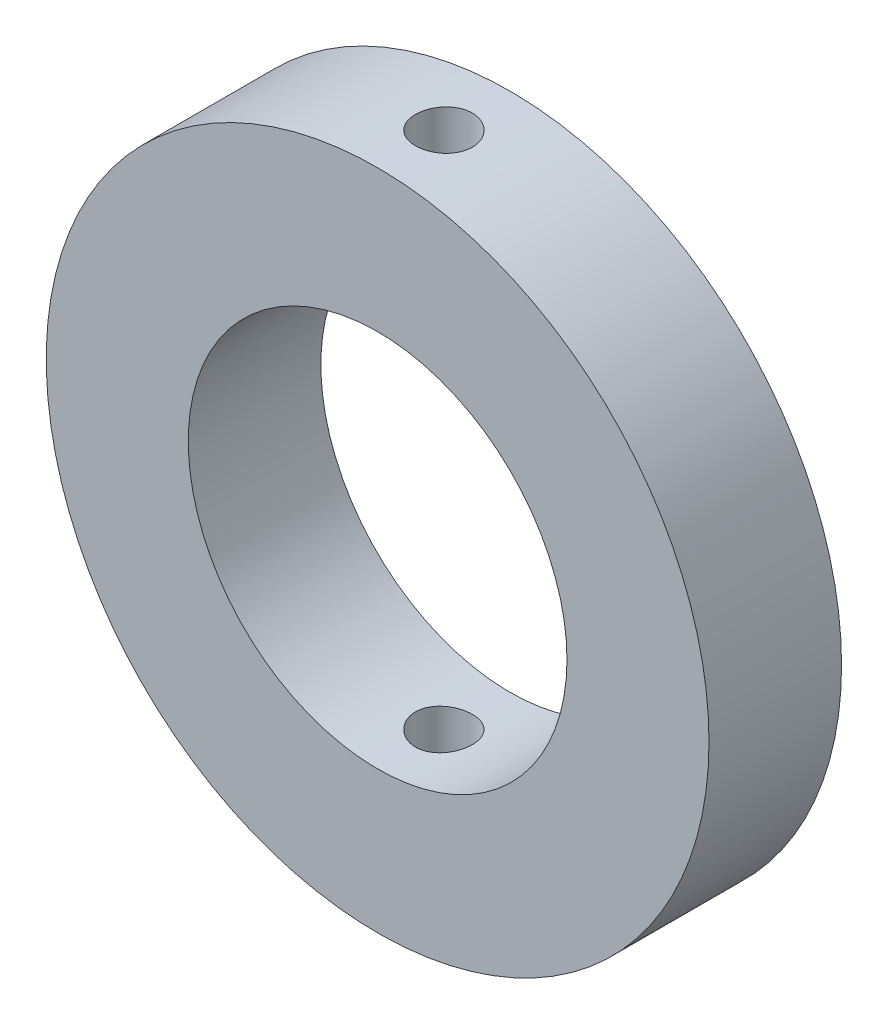
ISO-10303-21;
HEADER;
FILE_DESCRIPTION(('STEP AP214'),'2;1');
FILE_NAME('part.step','',(''),(''),'','','');
FILE_SCHEMA(('AUTOMOTIVE_DESIGN { 1 0 10303 214 1 1 1 1 }'));
ENDSEC;
DATA;
#1=APPLICATION_CONTEXT('core data for automotive mechanical design processes');
#2=APPLICATION_PROTOCOL_DEFINITION('international standard','automotive_design',2000,#1);
#3=PRODUCT_CONTEXT('',#1,'mechanical');
#4=PRODUCT('Part','Part','',(#3));
#5=PRODUCT_RELATED_PRODUCT_CATEGORY('part','',(#4));
#6=PRODUCT_DEFINITION_FORMATION('','',#4);
#7=PRODUCT_DEFINITION_CONTEXT('part definition',#1,'design');
#8=PRODUCT_DEFINITION('design','',#6,#7);
#9=PRODUCT_DEFINITION_SHAPE('','',#8);
#10=(LENGTH_UNIT() NAMED_UNIT(*) SI_UNIT(.MILLI.,.METRE.));
#11=(NAMED_UNIT(*) PLANE_ANGLE_UNIT() SI_UNIT($,.RADIAN.));
#12=(NAMED_UNIT(*) SI_UNIT($,.STERADIAN.) SOLID_ANGLE_UNIT());
#13=UNCERTAINTY_MEASURE_WITH_UNIT(LENGTH_MEASURE(1.E-05),#10,'distance_accuracy_value','');
#14=(GEOMETRIC_REPRESENTATION_CONTEXT(3) GLOBAL_UNCERTAINTY_ASSIGNED_CONTEXT((#13)) GLOBAL_UNIT_ASSIGNED_CONTEXT((#10,
#11,#12)) REPRESENTATION_CONTEXT('',''));
#15=CARTESIAN_POINT('',(0.,0.,0.));
#16=DIRECTION('',(0.,0.,1.));
#17=DIRECTION('',(1.,0.,0.));
#18=AXIS2_PLACEMENT_3D('',#15,#16,#17);
#19=CARTESIAN_POINT('',(0.,0.,7.));
#20=DIRECTION('',(0.,0.,1.));
#21=DIRECTION('',(1.,0.,0.));
#22=AXIS2_PLACEMENT_3D('',#19,#20,#21);
#23=PLANE('',#22);
#24=CARTESIAN_POINT('',(0.,0.,7.));
#25=DIRECTION('',(0.,0.,1.));
#26=DIRECTION('',(1.,0.,0.));
#27=AXIS2_PLACEMENT_3D('',#24,#25,#26);
#28=CIRCLE('',#27,17.5);
#29=CARTESIAN_POINT('',(17.5,0.,7.));
#30=VERTEX_POINT('',#29);
#31=EDGE_CURVE('E10',#30,#30,#28,.T.);
#32=ORIENTED_EDGE('',*,*,#31,.T.);
#33=EDGE_LOOP('',(#32));
#34=FACE_BOUND('',#33,.T.);
#35=CARTESIAN_POINT('',(0.,0.,7.));
#36=DIRECTION('',(0.,0.,1.));
#37=DIRECTION('',(1.,0.,0.));
#38=AXIS2_PLACEMENT_3D('',#35,#36,#37);
#39=CIRCLE('',#38,10.);
#40=CARTESIAN_POINT('',(10.,0.,7.));
#41=VERTEX_POINT('',#40);
#42=EDGE_CURVE('E55',#41,#41,#39,.T.);
#43=ORIENTED_EDGE('',*,*,#42,.F.);
#44=EDGE_LOOP('',(#43));
#45=FACE_BOUND('',#44,.T.);
#46=ADVANCED_FACE('F36',(#34,#45),#23,.T.);
#47=CARTESIAN_POINT('',(0.,0.,0.));
#48=DIRECTION('',(0.,0.,1.));
#49=DIRECTION('',(1.,0.,0.));
#50=AXIS2_PLACEMENT_3D('',#47,#48,#49);
#51=PLANE('',#50);
#52=CARTESIAN_POINT('',(0.,0.,0.));
#53=DIRECTION('',(0.,0.,1.));
#54=DIRECTION('',(1.,0.,0.));
#55=AXIS2_PLACEMENT_3D('',#52,#53,#54);
#56=CIRCLE('',#55,17.5);
#57=CARTESIAN_POINT('',(17.5,0.,0.));
#58=VERTEX_POINT('',#57);
#59=EDGE_CURVE('E50',#58,#58,#56,.T.);
#60=ORIENTED_EDGE('',*,*,#59,.F.);
#61=EDGE_LOOP('',(#60));
#62=FACE_BOUND('',#61,.T.);
#63=CARTESIAN_POINT('',(0.,0.,0.));
#64=DIRECTION('',(0.,0.,1.));
#65=DIRECTION('',(1.,0.,0.));
#66=AXIS2_PLACEMENT_3D('',#63,#64,#65);
#67=CIRCLE('',#66,10.);
#68=CARTESIAN_POINT('',(10.,0.,0.));
#69=VERTEX_POINT('',#68);
#70=EDGE_CURVE('E58',#69,#69,#67,.T.);
#71=ORIENTED_EDGE('',*,*,#70,.T.);
#72=EDGE_LOOP('',(#71));
#73=FACE_BOUND('',#72,.T.);
#74=ADVANCED_FACE('F94',(#62,#73),#51,.F.);
#75=CARTESIAN_POINT('',(0.,0.,7.));
#76=DIRECTION('',(0.,0.,-1.));
#77=DIRECTION('',(-1.,0.,0.));
#78=AXIS2_PLACEMENT_3D('',#75,#76,#77);
#79=CYLINDRICAL_SURFACE('',#78,17.5);
#80=CARTESIAN_POINT('',(0.,-17.5,5.));
#81=CARTESIAN_POINT('',(0.0840900887107123,-17.4999991594733,4.99999633105431));
#82=CARTESIAN_POINT('',(0.168237205347033,-17.4993874435045,4.9929050688566));
#83=CARTESIAN_POINT('',(0.334202638193609,-17.4970060027991,4.96472138311456));
#84=CARTESIAN_POINT('',(0.416018216761205,-17.4952349709134,4.94361315480395));
#85=CARTESIAN_POINT('',(0.574892903023323,-17.4907350049708,4.88801096542443));
#86=CARTESIAN_POINT('',(0.65195469695322,-17.4880066178289,4.85352464576534));
#87=CARTESIAN_POINT('',(0.799177678621249,-17.4818977976165,4.77215904202089));
#88=CARTESIAN_POINT('',(0.869340324379601,-17.478517502765,4.72528238418373));
#89=CARTESIAN_POINT('',(1.00098012086048,-17.4714739349038,4.62033085552535));
#90=CARTESIAN_POINT('',(1.0624361682522,-17.4678100065351,4.56222955660025));
#91=CARTESIAN_POINT('',(1.17473714274468,-17.4606176074471,4.43653395532203));
#92=CARTESIAN_POINT('',(1.22558160053927,-17.4570891427244,4.36893923333563));
#93=CARTESIAN_POINT('',(1.31528804394571,-17.4505601834405,4.22604711952868));
#94=CARTESIAN_POINT('',(1.3541313994292,-17.447560512831,4.15073799100038));
#95=CARTESIAN_POINT('',(1.41861401911449,-17.4424363752803,3.99463655208879));
#96=CARTESIAN_POINT('',(1.44425352872523,-17.4403118920728,3.91384434364657));
#97=CARTESIAN_POINT('',(1.48153922884676,-17.4371842440243,3.74928217785536));
#98=CARTESIAN_POINT('',(1.49321989768765,-17.4361783167802,3.66552008580619));
#99=CARTESIAN_POINT('',(1.50236286720603,-17.4353929686056,3.49721865783491));
#100=CARTESIAN_POINT('',(1.49982544877632,-17.4356135234447,3.41267933730069));
#101=CARTESIAN_POINT('',(1.48063275656642,-17.4372537073855,3.24545967504623));
#102=CARTESIAN_POINT('',(1.4640149768294,-17.4386701519636,3.1627749943305));
#103=CARTESIAN_POINT('',(1.41719154226227,-17.4425375250174,3.00137274937773));
#104=CARTESIAN_POINT('',(1.38698574798361,-17.4449884641096,2.92265522586332));
#105=CARTESIAN_POINT('',(1.31380181438494,-17.4506523313746,2.77130244880465));
#106=CARTESIAN_POINT('',(1.27080687785468,-17.4538662605277,2.69867535622966));
#107=CARTESIAN_POINT('',(1.17327723208652,-17.4606930646245,2.56165431191238));
#108=CARTESIAN_POINT('',(1.11874227540577,-17.4643059481219,2.49726053675762));
#109=CARTESIAN_POINT('',(0.99947045887247,-17.4715377484946,2.37831603911806));
#110=CARTESIAN_POINT('',(0.934701189276639,-17.4751566471183,2.32379780916566));
#111=CARTESIAN_POINT('',(0.79691230790879,-17.4819816038833,2.22640328146127));
#112=CARTESIAN_POINT('',(0.723892690194866,-17.4851876617273,2.18352699209389));
#113=CARTESIAN_POINT('',(0.571654568400853,-17.4908263664502,2.11063537405045));
#114=CARTESIAN_POINT('',(0.492435358600528,-17.4932589251192,2.08062151207312));
#115=CARTESIAN_POINT('',(0.330056610564175,-17.497075554016,2.03432962167256));
#116=CARTESIAN_POINT('',(0.246897158890748,-17.4984596472661,2.01805129164306));
#117=CARTESIAN_POINT('',(0.0792801254169853,-17.5000204405764,1.99973334895508));
#118=CARTESIAN_POINT('',(-0.00517251833806496,-17.50020094583,1.99764886143084));
#119=CARTESIAN_POINT('',(-0.173226052241329,-17.4993443933604,2.00766017788266));
#120=CARTESIAN_POINT('',(-0.256826950793808,-17.4983073476627,2.01975584180464));
#121=CARTESIAN_POINT('',(-0.420675710779483,-17.4951347543422,2.05774691116821));
#122=CARTESIAN_POINT('',(-0.500928436352369,-17.4930008648631,2.08362148858151));
#123=CARTESIAN_POINT('',(-0.655953511227377,-17.4878742551377,2.14841461003281));
#124=CARTESIAN_POINT('',(-0.730725769009281,-17.4848815205533,2.18733337183968));
#125=CARTESIAN_POINT('',(-0.872871440837197,-17.4783631237428,2.27722267647234));
#126=CARTESIAN_POINT('',(-0.940226014804557,-17.4748361561913,2.32822291576338));
#127=CARTESIAN_POINT('',(-1.06543412084655,-17.467649837578,2.44078460996224));
#128=CARTESIAN_POINT('',(-1.1232874782242,-17.4639904840836,2.50234625901808));
#129=CARTESIAN_POINT('',(-1.22800508301078,-17.4569405366366,2.63447813486955));
#130=CARTESIAN_POINT('',(-1.27484002450932,-17.4535506749448,2.70507163178117));
#131=CARTESIAN_POINT('',(-1.35599031614564,-17.4474340063892,2.85314762251097));
#132=CARTESIAN_POINT('',(-1.39030579747788,-17.4447071925772,2.93063004412785));
#133=CARTESIAN_POINT('',(-1.4453932712282,-17.4402295391797,3.090181105562));
#134=CARTESIAN_POINT('',(-1.46618313697926,-17.4384774120469,3.17224353672203));
#135=CARTESIAN_POINT('',(-1.49368739816738,-17.4361432515205,3.33871002868893));
#136=CARTESIAN_POINT('',(-1.5004020813581,-17.435561194206,3.42311404158866));
#137=CARTESIAN_POINT('',(-1.49956196176542,-17.4356334475388,3.59157653239517));
#138=CARTESIAN_POINT('',(-1.49205320334771,-17.4362837687124,3.67563524546447));
#139=CARTESIAN_POINT('',(-1.46307542778588,-17.4387390238802,3.84129296372411));
#140=CARTESIAN_POINT('',(-1.44160638999741,-17.4405439595818,3.92289196527686));
#141=CARTESIAN_POINT('',(-1.3853292896036,-17.4451040158272,4.08131651078694));
#142=CARTESIAN_POINT('',(-1.35052212863537,-17.447859072143,4.1581423769932));
#143=CARTESIAN_POINT('',(-1.26856192068809,-17.4540090548504,4.30486778789871));
#144=CARTESIAN_POINT('',(-1.2214090509481,-17.4574039720557,4.37476743201323));
#145=CARTESIAN_POINT('',(-1.11592285951566,-17.4644642414072,4.50589192296983));
#146=CARTESIAN_POINT('',(-1.05755540365527,-17.4681303976252,4.56708926650846));
#147=CARTESIAN_POINT('',(-0.931359803734685,-17.4753127111157,4.6788440133835));
#148=CARTESIAN_POINT('',(-0.863529377072589,-17.4788288319294,4.72939884219145));
#149=CARTESIAN_POINT('',(-0.720195326926258,-17.4853216091624,4.81850541422066));
#150=CARTESIAN_POINT('',(-0.644677026557885,-17.4882972023409,4.85703360517277));
#151=CARTESIAN_POINT('',(-0.488268737743217,-17.4933613340228,4.92081338883362));
#152=CARTESIAN_POINT('',(-0.407385029028375,-17.4954508890876,4.94608020442536));
#153=CARTESIAN_POINT('',(-0.271688875746323,-17.4979725842776,4.97620274715356));
#154=CARTESIAN_POINT('',(-0.21774845549635,-17.4987293930011,4.98511481222658));
#155=CARTESIAN_POINT('',(-0.109213375322046,-17.4997433731255,4.9970146217833));
#156=CARTESIAN_POINT('',(-0.0546187172544691,-17.5000005459441,5.00000238307641));
#157=CARTESIAN_POINT('',(0.,-17.5,5.));
#158=B_SPLINE_CURVE_WITH_KNOTS('',3,(#80,#81,#82,#83,#84,#85,#86,#87,#88,#89,#90,#91,#92,#93,
#94,#95,#96,#97,#98,#99,#100,#101,#102,#103,#104,#105,#106,#107,#108,#109,#110,#111,#112,#113,
#114,#115,#116,#117,#118,#119,#120,#121,#122,#123,#124,#125,#126,#127,#128,#129,#130,#131,#132,
#133,#134,#135,#136,#137,#138,#139,#140,#141,#142,#143,#144,#145,#146,#147,#148,#149,#150,#151,
#152,#153,#154,#155,#156,#157),.UNSPECIFIED.,.T.,.F.,(4,2,2,2,2,2,2,2,2,2,2,2,2,2,2,2,2,2,2,2,2,
2,2,2,2,2,2,2,2,2,2,2,2,2,2,2,2,2,4),(0.,0.252070844310374,0.504426393652047,0.756638012182109,
1.0087962149074,1.26155551650305,1.51432599421665,1.76748691573707,2.02064313179526,
2.27317275110476,2.525697381452,2.77755167951108,3.02940856231232,3.28159770462397,
3.53379225496101,3.78680207360298,4.03981207446395,4.29285091830753,4.54588420575254,
4.79811713708821,5.0503475771986,5.30219782677344,5.55405228112454,5.80653234151375,
6.05901704368432,6.31216587866226,6.5653120607557,6.81812304140249,7.07092885351994,
7.32291767673277,7.57490687258537,7.82687903735056,8.07884758491874,8.33159556665816,
8.58440462052468,8.83770569919965,9.09071537122188,9.25444245783791,9.41816907989973),.UNSPECIFIED.);
#159=CARTESIAN_POINT('',(0.,-17.5,5.));
#160=VERTEX_POINT('',#159);
#161=EDGE_CURVE('E83',#160,#160,#158,.T.);
#162=ORIENTED_EDGE('',*,*,#161,.T.);
#163=EDGE_LOOP('',(#162));
#164=FACE_BOUND('',#163,.T.);
#165=CARTESIAN_POINT('',(0.,17.5,5.));
#166=CARTESIAN_POINT('',(-0.0840900887107123,17.4999991594733,4.99999633105431));
#167=CARTESIAN_POINT('',(-0.168237205347033,17.4993874435045,4.9929050688566));
#168=CARTESIAN_POINT('',(-0.334202638193609,17.4970060027991,4.96472138311456));
#169=CARTESIAN_POINT('',(-0.416018216761205,17.4952349709134,4.94361315480395));
#170=CARTESIAN_POINT('',(-0.574892903023323,17.4907350049708,4.88801096542443));
#171=CARTESIAN_POINT('',(-0.65195469695322,17.4880066178289,4.85352464576534));
#172=CARTESIAN_POINT('',(-0.799177678621249,17.4818977976165,4.77215904202089));
#173=CARTESIAN_POINT('',(-0.869340324379601,17.478517502765,4.72528238418373));
#174=CARTESIAN_POINT('',(-1.00098012086048,17.4714739349038,4.62033085552535));
#175=CARTESIAN_POINT('',(-1.0624361682522,17.4678100065351,4.56222955660025));
#176=CARTESIAN_POINT('',(-1.17473714274468,17.4606176074471,4.43653395532203));
#177=CARTESIAN_POINT('',(-1.22558160053927,17.4570891427244,4.36893923333563));
#178=CARTESIAN_POINT('',(-1.31528804394571,17.4505601834405,4.22604711952868));
#179=CARTESIAN_POINT('',(-1.3541313994292,17.447560512831,4.15073799100038));
#180=CARTESIAN_POINT('',(-1.41861401911449,17.4424363752803,3.99463655208879));
#181=CARTESIAN_POINT('',(-1.44425352872523,17.4403118920728,3.91384434364657));
#182=CARTESIAN_POINT('',(-1.48153922884676,17.4371842440243,3.74928217785536));
#183=CARTESIAN_POINT('',(-1.49321989768765,17.4361783167802,3.66552008580619));
#184=CARTESIAN_POINT('',(-1.50236286720603,17.4353929686056,3.49721865783491));
#185=CARTESIAN_POINT('',(-1.49982544877632,17.4356135234447,3.41267933730069));
#186=CARTESIAN_POINT('',(-1.48063275656642,17.4372537073855,3.24545967504623));
#187=CARTESIAN_POINT('',(-1.4640149768294,17.4386701519636,3.1627749943305));
#188=CARTESIAN_POINT('',(-1.41719154226227,17.4425375250174,3.00137274937773));
#189=CARTESIAN_POINT('',(-1.38698574798361,17.4449884641096,2.92265522586332));
#190=CARTESIAN_POINT('',(-1.31380181438494,17.4506523313746,2.77130244880465));
#191=CARTESIAN_POINT('',(-1.27080687785468,17.4538662605277,2.69867535622966));
#192=CARTESIAN_POINT('',(-1.17327723208652,17.4606930646245,2.56165431191238));
#193=CARTESIAN_POINT('',(-1.11874227540577,17.4643059481219,2.49726053675762));
#194=CARTESIAN_POINT('',(-0.99947045887247,17.4715377484946,2.37831603911806));
#195=CARTESIAN_POINT('',(-0.934701189276639,17.4751566471183,2.32379780916566));
#196=CARTESIAN_POINT('',(-0.79691230790879,17.4819816038833,2.22640328146127));
#197=CARTESIAN_POINT('',(-0.723892690194866,17.4851876617273,2.18352699209389));
#198=CARTESIAN_POINT('',(-0.571654568400853,17.4908263664502,2.11063537405045));
#199=CARTESIAN_POINT('',(-0.492435358600528,17.4932589251192,2.08062151207312));
#200=CARTESIAN_POINT('',(-0.330056610564175,17.497075554016,2.03432962167256));
#201=CARTESIAN_POINT('',(-0.246897158890748,17.4984596472661,2.01805129164306));
#202=CARTESIAN_POINT('',(-0.0792801254169853,17.5000204405764,1.99973334895508));
#203=CARTESIAN_POINT('',(0.00517251833806496,17.50020094583,1.99764886143084));
#204=CARTESIAN_POINT('',(0.173226052241329,17.4993443933604,2.00766017788266));
#205=CARTESIAN_POINT('',(0.256826950793808,17.4983073476627,2.01975584180464));
#206=CARTESIAN_POINT('',(0.420675710779483,17.4951347543422,2.05774691116821));
#207=CARTESIAN_POINT('',(0.500928436352369,17.4930008648631,2.08362148858151));
#208=CARTESIAN_POINT('',(0.655953511227377,17.4878742551377,2.14841461003281));
#209=CARTESIAN_POINT('',(0.730725769009281,17.4848815205533,2.18733337183968));
#210=CARTESIAN_POINT('',(0.872871440837197,17.4783631237428,2.27722267647234));
#211=CARTESIAN_POINT('',(0.940226014804557,17.4748361561913,2.32822291576338));
#212=CARTESIAN_POINT('',(1.06543412084655,17.467649837578,2.44078460996224));
#213=CARTESIAN_POINT('',(1.1232874782242,17.4639904840836,2.50234625901808));
#214=CARTESIAN_POINT('',(1.22800508301078,17.4569405366366,2.63447813486955));
#215=CARTESIAN_POINT('',(1.27484002450932,17.4535506749448,2.70507163178117));
#216=CARTESIAN_POINT('',(1.35599031614564,17.4474340063892,2.85314762251097));
#217=CARTESIAN_POINT('',(1.39030579747788,17.4447071925772,2.93063004412785));
#218=CARTESIAN_POINT('',(1.4453932712282,17.4402295391797,3.090181105562));
#219=CARTESIAN_POINT('',(1.46618313697926,17.4384774120469,3.17224353672203));
#220=CARTESIAN_POINT('',(1.49368739816738,17.4361432515205,3.33871002868893));
#221=CARTESIAN_POINT('',(1.5004020813581,17.435561194206,3.42311404158866));
#222=CARTESIAN_POINT('',(1.49956196176542,17.4356334475388,3.59157653239517));
#223=CARTESIAN_POINT('',(1.49205320334771,17.4362837687124,3.67563524546447));
#224=CARTESIAN_POINT('',(1.46307542778588,17.4387390238802,3.84129296372411));
#225=CARTESIAN_POINT('',(1.44160638999741,17.4405439595818,3.92289196527686));
#226=CARTESIAN_POINT('',(1.3853292896036,17.4451040158272,4.08131651078694));
#227=CARTESIAN_POINT('',(1.35052212863537,17.447859072143,4.1581423769932));
#228=CARTESIAN_POINT('',(1.26856192068809,17.4540090548504,4.30486778789871));
#229=CARTESIAN_POINT('',(1.2214090509481,17.4574039720557,4.37476743201323));
#230=CARTESIAN_POINT('',(1.11592285951566,17.4644642414072,4.50589192296983));
#231=CARTESIAN_POINT('',(1.05755540365527,17.4681303976252,4.56708926650846));
#232=CARTESIAN_POINT('',(0.931359803734685,17.4753127111157,4.6788440133835));
#233=CARTESIAN_POINT('',(0.863529377072589,17.4788288319294,4.72939884219145));
#234=CARTESIAN_POINT('',(0.720195326926258,17.4853216091624,4.81850541422066));
#235=CARTESIAN_POINT('',(0.644677026557885,17.4882972023409,4.85703360517277));
#236=CARTESIAN_POINT('',(0.488268737743217,17.4933613340228,4.92081338883362));
#237=CARTESIAN_POINT('',(0.407385029028375,17.4954508890876,4.94608020442536));
#238=CARTESIAN_POINT('',(0.271688875746323,17.4979725842776,4.97620274715356));
#239=CARTESIAN_POINT('',(0.21774845549635,17.4987293930011,4.98511481222658));
#240=CARTESIAN_POINT('',(0.109213375322046,17.4997433731255,4.9970146217833));
#241=CARTESIAN_POINT('',(0.0546187172544691,17.5000005459441,5.00000238307641));
#242=CARTESIAN_POINT('',(0.,17.5,5.));
#243=B_SPLINE_CURVE_WITH_KNOTS('',3,(#165,#166,#167,#168,#169,#170,#171,#172,#173,#174,#175,
#176,#177,#178,#179,#180,#181,#182,#183,#184,#185,#186,#187,#188,#189,#190,#191,#192,#193,#194,
#195,#196,#197,#198,#199,#200,#201,#202,#203,#204,#205,#206,#207,#208,#209,#210,#211,#212,#213,
#214,#215,#216,#217,#218,#219,#220,#221,#222,#223,#224,#225,#226,#227,#228,#229,#230,#231,#232,
#233,#234,#235,#236,#237,#238,#239,#240,#241,#242),.UNSPECIFIED.,.T.,.F.,(4,2,2,2,2,2,2,2,2,2,2,
2,2,2,2,2,2,2,2,2,2,2,2,2,2,2,2,2,2,2,2,2,2,2,2,2,2,2,4),(0.,0.252070844310374,
0.504426393652047,0.756638012182109,1.0087962149074,1.26155551650305,1.51432599421665,
1.76748691573707,2.02064313179526,2.27317275110476,2.525697381452,2.77755167951108,
3.02940856231232,3.28159770462397,3.53379225496101,3.78680207360298,4.03981207446395,
4.29285091830753,4.54588420575254,4.79811713708821,5.0503475771986,5.30219782677344,
5.55405228112454,5.80653234151375,6.05901704368432,6.31216587866226,6.5653120607557,
6.81812304140249,7.07092885351994,7.32291767673277,7.57490687258537,7.82687903735056,
8.07884758491874,8.33159556665816,8.58440462052468,8.83770569919965,9.09071537122188,
9.25444245783791,9.41816907989973),.UNSPECIFIED.);
#244=CARTESIAN_POINT('',(0.,17.5,5.));
#245=VERTEX_POINT('',#244);
#246=EDGE_CURVE('E78',#245,#245,#243,.T.);
#247=ORIENTED_EDGE('',*,*,#246,.T.);
#248=EDGE_LOOP('',(#247));
#249=FACE_BOUND('',#248,.T.);
#250=ORIENTED_EDGE('',*,*,#31,.F.);
#251=EDGE_LOOP('',(#250));
#252=FACE_BOUND('',#251,.T.);
#253=ORIENTED_EDGE('',*,*,#59,.T.);
#254=EDGE_LOOP('',(#253));
#255=FACE_BOUND('',#254,.T.);
#256=ADVANCED_FACE('F38',(#164,#249,#252,#255),#79,.T.);
#257=CARTESIAN_POINT('',(0.,0.,7.));
#258=DIRECTION('',(0.,0.,-1.));
#259=DIRECTION('',(-1.,0.,0.));
#260=AXIS2_PLACEMENT_3D('',#257,#258,#259);
#261=CYLINDRICAL_SURFACE('',#260,10.);
#262=CARTESIAN_POINT('',(0.,-10.,5.));
#263=CARTESIAN_POINT('',(0.083751544481642,-9.99999865771297,4.99999654618476));
#264=CARTESIAN_POINT('',(0.167551685082131,-9.9989368253704,4.99296199915937));
#265=CARTESIAN_POINT('',(0.332809627994913,-9.99480315973187,4.96501680001725));
#266=CARTESIAN_POINT('',(0.414265068974229,-9.99172936938473,4.94409263705511));
#267=CARTESIAN_POINT('',(0.57241808622186,-9.98391721219526,4.88900749503238));
#268=CARTESIAN_POINT('',(0.649119207826798,-9.97918010370919,4.85485652049405));
#269=CARTESIAN_POINT('',(0.795690428635254,-9.96856475911724,4.77431162058314));
#270=CARTESIAN_POINT('',(0.865561474725188,-9.96268668152773,4.72791939558264));
#271=CARTESIAN_POINT('',(0.997046719562126,-9.95039170991452,4.62382273506013));
#272=CARTESIAN_POINT('',(1.0585998322255,-9.94397133890331,4.5660415437918));
#273=CARTESIAN_POINT('',(1.17117490668948,-9.93134261133238,4.44097231110613));
#274=CARTESIAN_POINT('',(1.22219626272936,-9.92513426698505,4.37368372322148));
#275=CARTESIAN_POINT('',(1.31249729499943,-9.91359877458726,4.23109935647751));
#276=CARTESIAN_POINT('',(1.35171787037205,-9.90827611975031,4.15576575301866));
#277=CARTESIAN_POINT('',(1.41692632171056,-9.89916211306268,3.99948717935457));
#278=CARTESIAN_POINT('',(1.44291491889163,-9.89537067775449,3.91854251525611));
#279=CARTESIAN_POINT('',(1.48073198798911,-9.88978256218673,3.75398195812829));
#280=CARTESIAN_POINT('',(1.49266503640518,-9.8879711574125,3.67039060659198));
#281=CARTESIAN_POINT('',(1.50235624033932,-9.88650348970582,3.50237383401272));
#282=CARTESIAN_POINT('',(1.50011520973796,-9.88684710303147,3.41794846113751));
#283=CARTESIAN_POINT('',(1.48160733250788,-9.88963718352409,3.25139891980586));
#284=CARTESIAN_POINT('',(1.4654569592775,-9.89206618761549,3.1692614735152));
#285=CARTESIAN_POINT('',(1.41977117403734,-9.89872608126367,3.00887563112847));
#286=CARTESIAN_POINT('',(1.39023538337812,-9.90295702179379,2.93062734511926));
#287=CARTESIAN_POINT('',(1.31849603529736,-9.91276335545481,2.77988662871714));
#288=CARTESIAN_POINT('',(1.27624314283198,-9.91834396766526,2.70741803090761));
#289=CARTESIAN_POINT('',(1.18030413128955,-9.93021707574548,2.57055540421807));
#290=CARTESIAN_POINT('',(1.12661726182478,-9.93650961832501,2.50616190573063));
#291=CARTESIAN_POINT('',(1.00869493078248,-9.94917473056209,2.38660233926028));
#292=CARTESIAN_POINT('',(0.944359329642002,-9.95554747112815,2.33153500971366));
#293=CARTESIAN_POINT('',(0.807307089894186,-9.96759647648462,2.23296406549274));
#294=CARTESIAN_POINT('',(0.73459041458817,-9.9732727382251,2.1894605014561));
#295=CARTESIAN_POINT('',(0.582754598213686,-9.98329515585393,2.11524691350045));
#296=CARTESIAN_POINT('',(0.50363167783678,-9.98764051925428,2.0845445081597));
#297=CARTESIAN_POINT('',(0.34127318248706,-9.99450490557069,2.03689061031463));
#298=CARTESIAN_POINT('',(0.2580378859526,-9.99702405195467,2.01993818818442));
#299=CARTESIAN_POINT('',(0.0906695676436465,-9.99993581133871,2.00039677018331));
#300=CARTESIAN_POINT('',(0.00655273187047079,-10.0003485209039,1.99767202862068));
#301=CARTESIAN_POINT('',(-0.160936677662282,-9.99905561015226,2.00630300531102));
#302=CARTESIAN_POINT('',(-0.244309274381877,-9.99735005541369,2.0176582876681));
#303=CARTESIAN_POINT('',(-0.407532387431408,-9.99202468615333,2.05401410017754));
#304=CARTESIAN_POINT('',(-0.487397963079838,-9.98841415207984,2.07894849603085));
#305=CARTESIAN_POINT('',(-0.641814958642999,-9.97968235658369,2.14168499746176));
#306=CARTESIAN_POINT('',(-0.716366128795099,-9.97456102421565,2.17948770733363));
#307=CARTESIAN_POINT('',(-0.858634979291921,-9.96332682468686,2.26720622456386));
#308=CARTESIAN_POINT('',(-0.926299009891566,-9.95720701626745,2.31720814001277));
#309=CARTESIAN_POINT('',(-1.05232367317771,-9.94467863012165,2.42778581162875));
#310=CARTESIAN_POINT('',(-1.1106837647934,-9.93827003562867,2.48836218232465));
#311=CARTESIAN_POINT('',(-1.21693784957195,-9.92582264304494,2.61897353317649));
#312=CARTESIAN_POINT('',(-1.26474084747421,-9.91978736017588,2.68908292519477));
#313=CARTESIAN_POINT('',(-1.34789129270584,-9.90883219104903,2.83641604051177));
#314=CARTESIAN_POINT('',(-1.38323907656436,-9.90391227465628,2.91363957152146));
#315=CARTESIAN_POINT('',(-1.44033467323943,-9.89577033008645,3.07273753362313));
#316=CARTESIAN_POINT('',(-1.46213037141635,-9.89254233006438,3.15459446097124));
#317=CARTESIAN_POINT('',(-1.49165549501586,-9.88813382297802,3.32085901543511));
#318=CARTESIAN_POINT('',(-1.49938589183066,-9.88695317451771,3.40526646599467));
#319=CARTESIAN_POINT('',(-1.5005378666944,-9.88677832610841,3.57332906331578));
#320=CARTESIAN_POINT('',(-1.49410252167313,-9.88776226333502,3.65698324175692));
#321=CARTESIAN_POINT('',(-1.46741229544379,-9.89175820611174,3.82200526332352));
#322=CARTESIAN_POINT('',(-1.44715743638627,-9.89477020841118,3.90337311011339));
#323=CARTESIAN_POINT('',(-1.39345373518665,-9.90247526112297,4.06147308223432));
#324=CARTESIAN_POINT('',(-1.36001489324314,-9.90716703716075,4.13820867043344));
#325=CARTESIAN_POINT('',(-1.28090667642309,-9.91770454557702,4.2850036338024));
#326=CARTESIAN_POINT('',(-1.23523688741502,-9.92355031702724,4.35506278280364));
#327=CARTESIAN_POINT('',(-1.13244337659164,-9.93580743364938,4.48724305797517));
#328=CARTESIAN_POINT('',(-1.07521369039806,-9.94222367881967,4.54928133324707));
#329=CARTESIAN_POINT('',(-0.951148841082836,-9.95485788826636,4.66292455478782));
#330=CARTESIAN_POINT('',(-0.884311448350942,-9.96107580610759,4.71452707257616));
#331=CARTESIAN_POINT('',(-0.742495707543722,-9.9726518579052,4.80608767660736));
#332=CARTESIAN_POINT('',(-0.667474576764761,-9.9780050712882,4.84598010921475));
#333=CARTESIAN_POINT('',(-0.51175187024872,-9.98720028802959,4.91253851675805));
#334=CARTESIAN_POINT('',(-0.431056277096705,-9.99104385565757,4.93921819005369));
#335=CARTESIAN_POINT('',(-0.29166572788933,-9.99590939261505,4.97254134271011));
#336=CARTESIAN_POINT('',(-0.23383113349528,-9.99743549179557,4.98282260153881));
#337=CARTESIAN_POINT('',(-0.117338971600126,-9.99948125947896,4.99655309771264));
#338=CARTESIAN_POINT('',(-0.0586814143344176,-10.0000009404877,5.00000241995255));
#339=CARTESIAN_POINT('',(0.,-10.,5.));
#340=B_SPLINE_CURVE_WITH_KNOTS('',3,(#262,#263,#264,#265,#266,#267,#268,#269,#270,#271,#272,
#273,#274,#275,#276,#277,#278,#279,#280,#281,#282,#283,#284,#285,#286,#287,#288,#289,#290,#291,
#292,#293,#294,#295,#296,#297,#298,#299,#300,#301,#302,#303,#304,#305,#306,#307,#308,#309,#310,
#311,#312,#313,#314,#315,#316,#317,#318,#319,#320,#321,#322,#323,#324,#325,#326,#327,#328,#329,
#330,#331,#332,#333,#334,#335,#336,#337,#338,#339),.UNSPECIFIED.,.T.,.F.,(4,2,2,2,2,2,2,2,2,2,2,
2,2,2,2,2,2,2,2,2,2,2,2,2,2,2,2,2,2,2,2,2,2,2,2,2,2,2,4),(0.,0.251040205031663,0.50232496292915,
0.753420023583237,1.0044802241976,1.25729416136843,1.5101226357258,1.76419702395375,
2.01825756225506,2.27041564605924,2.52255925098982,2.77261177195746,3.02267136690361,
3.27371383476159,3.52477278308534,3.77834291255409,4.03191415238668,4.28563608984874,
4.53934087193401,4.79062058544255,5.04189251991155,5.29195148965948,5.54202220376273,
5.79391188036907,6.04581620028629,6.29981366584672,6.55380426808832,6.80689223457168,
7.05996272137176,7.31048888261064,7.56101464229564,7.81135073984146,8.06169531466879,
8.3144482996572,8.56726003468733,8.82146323384733,9.07540233261441,9.25129851978808,
9.42719252123291),.UNSPECIFIED.);
#341=CARTESIAN_POINT('',(0.,-10.,5.));
#342=VERTEX_POINT('',#341);
#343=EDGE_CURVE('E41',#342,#342,#340,.T.);
#344=ORIENTED_EDGE('',*,*,#343,.F.);
#345=EDGE_LOOP('',(#344));
#346=FACE_BOUND('',#345,.T.);
#347=CARTESIAN_POINT('',(0.,10.,5.));
#348=CARTESIAN_POINT('',(-0.083751544481642,9.99999865771297,4.99999654618476));
#349=CARTESIAN_POINT('',(-0.167551685082131,9.9989368253704,4.99296199915937));
#350=CARTESIAN_POINT('',(-0.332809627994913,9.99480315973187,4.96501680001725));
#351=CARTESIAN_POINT('',(-0.414265068974229,9.99172936938473,4.94409263705511));
#352=CARTESIAN_POINT('',(-0.57241808622186,9.98391721219526,4.88900749503238));
#353=CARTESIAN_POINT('',(-0.649119207826798,9.97918010370919,4.85485652049405));
#354=CARTESIAN_POINT('',(-0.795690428635254,9.96856475911724,4.77431162058314));
#355=CARTESIAN_POINT('',(-0.865561474725188,9.96268668152773,4.72791939558264));
#356=CARTESIAN_POINT('',(-0.997046719562126,9.95039170991452,4.62382273506013));
#357=CARTESIAN_POINT('',(-1.0585998322255,9.94397133890331,4.5660415437918));
#358=CARTESIAN_POINT('',(-1.17117490668948,9.93134261133238,4.44097231110613));
#359=CARTESIAN_POINT('',(-1.22219626272936,9.92513426698505,4.37368372322148));
#360=CARTESIAN_POINT('',(-1.31249729499943,9.91359877458726,4.23109935647751));
#361=CARTESIAN_POINT('',(-1.35171787037205,9.90827611975031,4.15576575301866));
#362=CARTESIAN_POINT('',(-1.41692632171056,9.89916211306268,3.99948717935457));
#363=CARTESIAN_POINT('',(-1.44291491889163,9.89537067775449,3.91854251525611));
#364=CARTESIAN_POINT('',(-1.48073198798911,9.88978256218673,3.75398195812829));
#365=CARTESIAN_POINT('',(-1.49266503640518,9.8879711574125,3.67039060659198));
#366=CARTESIAN_POINT('',(-1.50235624033932,9.88650348970582,3.50237383401272));
#367=CARTESIAN_POINT('',(-1.50011520973796,9.88684710303147,3.41794846113751));
#368=CARTESIAN_POINT('',(-1.48160733250788,9.88963718352409,3.25139891980586));
#369=CARTESIAN_POINT('',(-1.4654569592775,9.89206618761549,3.1692614735152));
#370=CARTESIAN_POINT('',(-1.41977117403734,9.89872608126367,3.00887563112847));
#371=CARTESIAN_POINT('',(-1.39023538337812,9.90295702179379,2.93062734511926));
#372=CARTESIAN_POINT('',(-1.31849603529736,9.91276335545481,2.77988662871714));
#373=CARTESIAN_POINT('',(-1.27624314283198,9.91834396766526,2.70741803090761));
#374=CARTESIAN_POINT('',(-1.18030413128955,9.93021707574548,2.57055540421807));
#375=CARTESIAN_POINT('',(-1.12661726182478,9.93650961832501,2.50616190573063));
#376=CARTESIAN_POINT('',(-1.00869493078248,9.94917473056209,2.38660233926028));
#377=CARTESIAN_POINT('',(-0.944359329642002,9.95554747112815,2.33153500971366));
#378=CARTESIAN_POINT('',(-0.807307089894186,9.96759647648462,2.23296406549274));
#379=CARTESIAN_POINT('',(-0.73459041458817,9.9732727382251,2.1894605014561));
#380=CARTESIAN_POINT('',(-0.582754598213686,9.98329515585393,2.11524691350045));
#381=CARTESIAN_POINT('',(-0.50363167783678,9.98764051925428,2.0845445081597));
#382=CARTESIAN_POINT('',(-0.34127318248706,9.99450490557069,2.03689061031463));
#383=CARTESIAN_POINT('',(-0.2580378859526,9.99702405195467,2.01993818818442));
#384=CARTESIAN_POINT('',(-0.0906695676436465,9.99993581133871,2.00039677018331));
#385=CARTESIAN_POINT('',(-0.00655273187047079,10.0003485209039,1.99767202862068));
#386=CARTESIAN_POINT('',(0.160936677662282,9.99905561015226,2.00630300531102));
#387=CARTESIAN_POINT('',(0.244309274381877,9.99735005541369,2.0176582876681));
#388=CARTESIAN_POINT('',(0.407532387431408,9.99202468615333,2.05401410017754));
#389=CARTESIAN_POINT('',(0.487397963079838,9.98841415207984,2.07894849603085));
#390=CARTESIAN_POINT('',(0.641814958642999,9.97968235658369,2.14168499746176));
#391=CARTESIAN_POINT('',(0.716366128795099,9.97456102421565,2.17948770733363));
#392=CARTESIAN_POINT('',(0.858634979291921,9.96332682468686,2.26720622456386));
#393=CARTESIAN_POINT('',(0.926299009891566,9.95720701626745,2.31720814001277));
#394=CARTESIAN_POINT('',(1.05232367317771,9.94467863012165,2.42778581162875));
#395=CARTESIAN_POINT('',(1.1106837647934,9.93827003562867,2.48836218232465));
#396=CARTESIAN_POINT('',(1.21693784957195,9.92582264304494,2.61897353317649));
#397=CARTESIAN_POINT('',(1.26474084747421,9.91978736017588,2.68908292519477));
#398=CARTESIAN_POINT('',(1.34789129270584,9.90883219104903,2.83641604051177));
#399=CARTESIAN_POINT('',(1.38323907656436,9.90391227465628,2.91363957152146));
#400=CARTESIAN_POINT('',(1.44033467323943,9.89577033008645,3.07273753362313));
#401=CARTESIAN_POINT('',(1.46213037141635,9.89254233006438,3.15459446097124));
#402=CARTESIAN_POINT('',(1.49165549501586,9.88813382297802,3.32085901543511));
#403=CARTESIAN_POINT('',(1.49938589183066,9.88695317451771,3.40526646599467));
#404=CARTESIAN_POINT('',(1.5005378666944,9.88677832610841,3.57332906331578));
#405=CARTESIAN_POINT('',(1.49410252167313,9.88776226333502,3.65698324175692));
#406=CARTESIAN_POINT('',(1.46741229544379,9.89175820611174,3.82200526332352));
#407=CARTESIAN_POINT('',(1.44715743638627,9.89477020841118,3.90337311011339));
#408=CARTESIAN_POINT('',(1.39345373518665,9.90247526112297,4.06147308223432));
#409=CARTESIAN_POINT('',(1.36001489324314,9.90716703716075,4.13820867043344));
#410=CARTESIAN_POINT('',(1.28090667642309,9.91770454557702,4.2850036338024));
#411=CARTESIAN_POINT('',(1.23523688741502,9.92355031702724,4.35506278280364));
#412=CARTESIAN_POINT('',(1.13244337659164,9.93580743364938,4.48724305797517));
#413=CARTESIAN_POINT('',(1.07521369039806,9.94222367881967,4.54928133324707));
#414=CARTESIAN_POINT('',(0.951148841082836,9.95485788826636,4.66292455478782));
#415=CARTESIAN_POINT('',(0.884311448350942,9.96107580610759,4.71452707257616));
#416=CARTESIAN_POINT('',(0.742495707543722,9.9726518579052,4.80608767660736));
#417=CARTESIAN_POINT('',(0.667474576764761,9.9780050712882,4.84598010921475));
#418=CARTESIAN_POINT('',(0.51175187024872,9.98720028802959,4.91253851675805));
#419=CARTESIAN_POINT('',(0.431056277096705,9.99104385565757,4.93921819005369));
#420=CARTESIAN_POINT('',(0.29166572788933,9.99590939261505,4.97254134271011));
#421=CARTESIAN_POINT('',(0.23383113349528,9.99743549179557,4.98282260153881));
#422=CARTESIAN_POINT('',(0.117338971600126,9.99948125947896,4.99655309771264));
#423=CARTESIAN_POINT('',(0.0586814143344176,10.0000009404877,5.00000241995255));
#424=CARTESIAN_POINT('',(0.,10.,5.));
#425=B_SPLINE_CURVE_WITH_KNOTS('',3,(#347,#348,#349,#350,#351,#352,#353,#354,#355,#356,#357,
#358,#359,#360,#361,#362,#363,#364,#365,#366,#367,#368,#369,#370,#371,#372,#373,#374,#375,#376,
#377,#378,#379,#380,#381,#382,#383,#384,#385,#386,#387,#388,#389,#390,#391,#392,#393,#394,#395,
#396,#397,#398,#399,#400,#401,#402,#403,#404,#405,#406,#407,#408,#409,#410,#411,#412,#413,#414,
#415,#416,#417,#418,#419,#420,#421,#422,#423,#424),.UNSPECIFIED.,.T.,.F.,(4,2,2,2,2,2,2,2,2,2,2,
2,2,2,2,2,2,2,2,2,2,2,2,2,2,2,2,2,2,2,2,2,2,2,2,2,2,2,4),(0.,0.251040205031663,0.50232496292915,
0.753420023583237,1.0044802241976,1.25729416136843,1.5101226357258,1.76419702395375,
2.01825756225506,2.27041564605924,2.52255925098982,2.77261177195746,3.02267136690361,
3.27371383476159,3.52477278308534,3.77834291255409,4.03191415238668,4.28563608984874,
4.53934087193401,4.79062058544255,5.04189251991155,5.29195148965948,5.54202220376273,
5.79391188036907,6.04581620028629,6.29981366584672,6.55380426808832,6.80689223457168,
7.05996272137176,7.31048888261064,7.56101464229564,7.81135073984146,8.06169531466879,
8.3144482996572,8.56726003468733,8.82146323384733,9.07540233261441,9.25129851978808,
9.42719252123291),.UNSPECIFIED.);
#426=CARTESIAN_POINT('',(0.,10.,5.));
#427=VERTEX_POINT('',#426);
#428=EDGE_CURVE('E60',#427,#427,#425,.T.);
#429=ORIENTED_EDGE('',*,*,#428,.F.);
#430=EDGE_LOOP('',(#429));
#431=FACE_BOUND('',#430,.T.);
#432=ORIENTED_EDGE('',*,*,#42,.T.);
#433=EDGE_LOOP('',(#432));
#434=FACE_BOUND('',#433,.T.);
#435=ORIENTED_EDGE('',*,*,#70,.F.);
#436=EDGE_LOOP('',(#435));
#437=FACE_BOUND('',#436,.T.);
#438=ADVANCED_FACE('F65',(#346,#431,#434,#437),#261,.F.);
#439=CARTESIAN_POINT('',(0.,-17.5,3.5));
#440=DIRECTION('',(0.,1.,0.));
#441=DIRECTION('',(0.,0.,1.));
#442=AXIS2_PLACEMENT_3D('',#439,#440,#441);
#443=CYLINDRICAL_SURFACE('',#442,1.5);
#444=ORIENTED_EDGE('',*,*,#428,.T.);
#445=EDGE_LOOP('',(#444));
#446=FACE_BOUND('',#445,.T.);
#447=ORIENTED_EDGE('',*,*,#246,.F.);
#448=EDGE_LOOP('',(#447));
#449=FACE_BOUND('',#448,.T.);
#450=ADVANCED_FACE('F71',(#446,#449),#443,.F.);
#451=ORIENTED_EDGE('',*,*,#343,.T.);
#452=EDGE_LOOP('',(#451));
#453=FACE_BOUND('',#452,.T.);
#454=ORIENTED_EDGE('',*,*,#161,.F.);
#455=EDGE_LOOP('',(#454));
#456=FACE_BOUND('',#455,.T.);
#457=ADVANCED_FACE('F68',(#453,#456),#443,.F.);
#458=CLOSED_SHELL('',(#46,#74,#256,#438,#450,#457));
#459=MANIFOLD_SOLID_BREP('B2',#458);
#460=ADVANCED_BREP_SHAPE_REPRESENTATION('',(#18,#459),#14);
#461=SHAPE_DEFINITION_REPRESENTATION(#9,#460);
ENDSEC;
END-ISO-10303-21;
